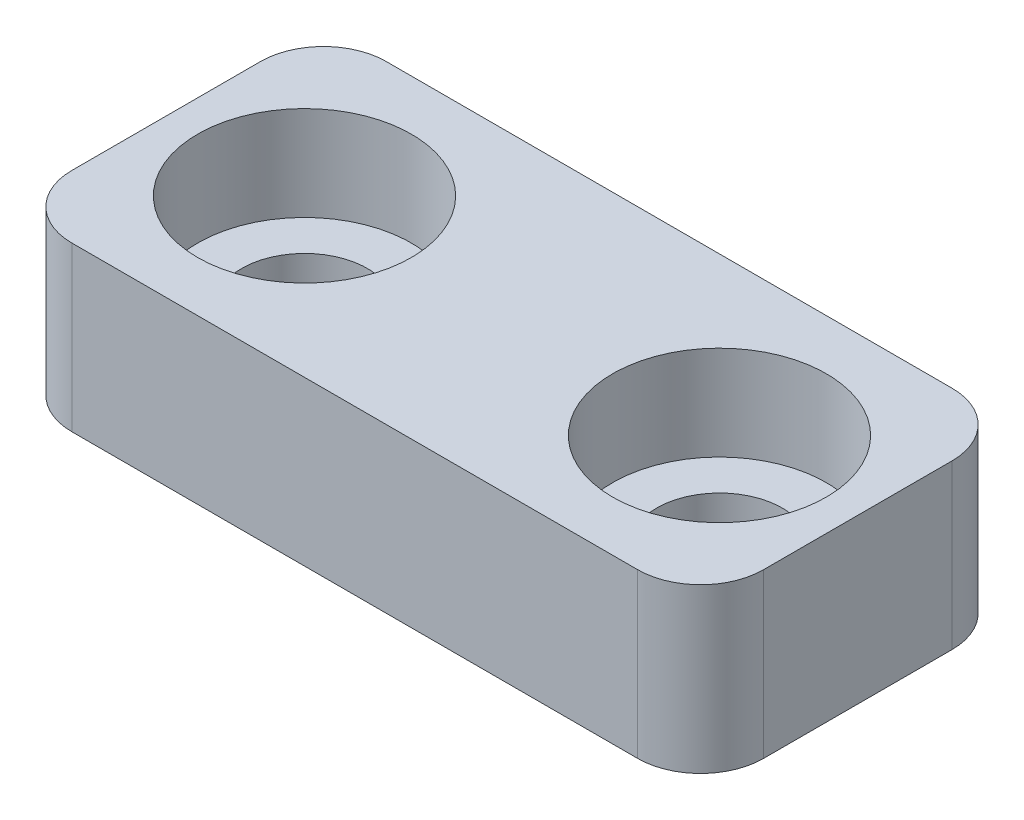
ISO-10303-21;
HEADER;
FILE_DESCRIPTION(('STEP AP214'),'2;1');
FILE_NAME('part.step','',(''),(''),'','','');
FILE_SCHEMA(('AUTOMOTIVE_DESIGN { 1 0 10303 214 1 1 1 1 }'));
ENDSEC;
DATA;
#1=APPLICATION_CONTEXT('core data for automotive mechanical design processes');
#2=APPLICATION_PROTOCOL_DEFINITION('international standard','automotive_design',2000,#1);
#3=PRODUCT_CONTEXT('',#1,'mechanical');
#4=PRODUCT('Part','Part','',(#3));
#5=PRODUCT_RELATED_PRODUCT_CATEGORY('part','',(#4));
#6=PRODUCT_DEFINITION_FORMATION('','',#4);
#7=PRODUCT_DEFINITION_CONTEXT('part definition',#1,'design');
#8=PRODUCT_DEFINITION('design','',#6,#7);
#9=PRODUCT_DEFINITION_SHAPE('','',#8);
#10=(LENGTH_UNIT() NAMED_UNIT(*) SI_UNIT(.MILLI.,.METRE.));
#11=(NAMED_UNIT(*) PLANE_ANGLE_UNIT() SI_UNIT($,.RADIAN.));
#12=(NAMED_UNIT(*) SI_UNIT($,.STERADIAN.) SOLID_ANGLE_UNIT());
#13=UNCERTAINTY_MEASURE_WITH_UNIT(LENGTH_MEASURE(1.E-05),#10,'distance_accuracy_value','');
#14=(GEOMETRIC_REPRESENTATION_CONTEXT(3) GLOBAL_UNCERTAINTY_ASSIGNED_CONTEXT((#13)) GLOBAL_UNIT_ASSIGNED_CONTEXT((#10,
#11,#12)) REPRESENTATION_CONTEXT('',''));
#15=CARTESIAN_POINT('',(0.,0.,0.));
#16=DIRECTION('',(0.,0.,1.));
#17=DIRECTION('',(1.,0.,0.));
#18=AXIS2_PLACEMENT_3D('',#15,#16,#17);
#19=CARTESIAN_POINT('',(3.30000000000001,2.6,0.));
#20=DIRECTION('',(0.,-1.,0.));
#21=DIRECTION('',(0.,0.,-1.));
#22=AXIS2_PLACEMENT_3D('',#19,#20,#21);
#23=CYLINDRICAL_SURFACE('',#22,0.999999999999999);
#24=CARTESIAN_POINT('',(3.30000000000001,0.,0.));
#25=DIRECTION('',(0.,1.,0.));
#26=DIRECTION('',(0.,0.,1.));
#27=AXIS2_PLACEMENT_3D('',#24,#25,#26);
#28=CIRCLE('',#27,0.999999999999999);
#29=CARTESIAN_POINT('',(3.30000000000001,0.,0.999999999999999));
#30=VERTEX_POINT('',#29);
#31=EDGE_CURVE('E136',#30,#30,#28,.T.);
#32=ORIENTED_EDGE('',*,*,#31,.F.);
#33=EDGE_LOOP('',(#32));
#34=FACE_BOUND('',#33,.T.);
#35=CARTESIAN_POINT('',(3.30000000000001,1.1,0.));
#36=DIRECTION('',(0.,1.,0.));
#37=DIRECTION('',(0.,0.,1.));
#38=AXIS2_PLACEMENT_3D('',#35,#36,#37);
#39=CIRCLE('',#38,0.999999999999999);
#40=CARTESIAN_POINT('',(3.30000000000001,1.1,0.999999999999999));
#41=VERTEX_POINT('',#40);
#42=EDGE_CURVE('E149',#41,#41,#39,.T.);
#43=ORIENTED_EDGE('',*,*,#42,.T.);
#44=EDGE_LOOP('',(#43));
#45=FACE_BOUND('',#44,.T.);
#46=ADVANCED_FACE('F36',(#34,#45),#23,.F.);
#47=CARTESIAN_POINT('',(-3.29999999999999,2.6,0.));
#48=DIRECTION('',(0.,-1.,0.));
#49=DIRECTION('',(0.,0.,-1.));
#50=AXIS2_PLACEMENT_3D('',#47,#48,#49);
#51=CYLINDRICAL_SURFACE('',#50,1.);
#52=CARTESIAN_POINT('',(-3.29999999999999,0.,0.));
#53=DIRECTION('',(0.,1.,0.));
#54=DIRECTION('',(0.,0.,1.));
#55=AXIS2_PLACEMENT_3D('',#52,#53,#54);
#56=CIRCLE('',#55,1.);
#57=CARTESIAN_POINT('',(-3.29999999999999,0.,1.));
#58=VERTEX_POINT('',#57);
#59=EDGE_CURVE('E130',#58,#58,#56,.T.);
#60=ORIENTED_EDGE('',*,*,#59,.F.);
#61=EDGE_LOOP('',(#60));
#62=FACE_BOUND('',#61,.T.);
#63=CARTESIAN_POINT('',(-3.29999999999999,1.1,0.));
#64=DIRECTION('',(0.,1.,0.));
#65=DIRECTION('',(0.,0.,1.));
#66=AXIS2_PLACEMENT_3D('',#63,#64,#65);
#67=CIRCLE('',#66,1.);
#68=CARTESIAN_POINT('',(-3.29999999999999,1.1,1.));
#69=VERTEX_POINT('',#68);
#70=EDGE_CURVE('E145',#69,#69,#67,.T.);
#71=ORIENTED_EDGE('',*,*,#70,.T.);
#72=EDGE_LOOP('',(#71));
#73=FACE_BOUND('',#72,.T.);
#74=ADVANCED_FACE('F216',(#62,#73),#51,.F.);
#75=CARTESIAN_POINT('',(0.,2.6,0.));
#76=DIRECTION('',(0.,-1.,0.));
#77=DIRECTION('',(0.,0.,-1.));
#78=AXIS2_PLACEMENT_3D('',#75,#76,#77);
#79=PLANE('',#78);
#80=CARTESIAN_POINT('',(3.30000000000001,2.6,0.));
#81=DIRECTION('',(0.,1.,0.));
#82=DIRECTION('',(0.,0.,1.));
#83=AXIS2_PLACEMENT_3D('',#80,#81,#82);
#84=CIRCLE('',#83,1.7);
#85=CARTESIAN_POINT('',(3.30000000000001,2.6,1.7));
#86=VERTEX_POINT('',#85);
#87=EDGE_CURVE('E198',#86,#86,#84,.T.);
#88=ORIENTED_EDGE('',*,*,#87,.F.);
#89=EDGE_LOOP('',(#88));
#90=FACE_BOUND('',#89,.T.);
#91=CARTESIAN_POINT('',(-3.29999999999999,2.6,0.));
#92=DIRECTION('',(0.,1.,0.));
#93=DIRECTION('',(0.,0.,1.));
#94=AXIS2_PLACEMENT_3D('',#91,#92,#93);
#95=CIRCLE('',#94,1.7);
#96=CARTESIAN_POINT('',(-3.29999999999999,2.6,1.7));
#97=VERTEX_POINT('',#96);
#98=EDGE_CURVE('E152',#97,#97,#95,.T.);
#99=ORIENTED_EDGE('',*,*,#98,.F.);
#100=EDGE_LOOP('',(#99));
#101=FACE_BOUND('',#100,.T.);
#102=DIRECTION('',(1.,0.,0.));
#103=VECTOR('',#102,1.);
#104=CARTESIAN_POINT('',(-5.49999999999999,2.6,2.50000000000001));
#105=LINE('',#104,#103);
#106=CARTESIAN_POINT('',(-4.49999999999999,2.6,2.50000000000001));
#107=VERTEX_POINT('',#106);
#108=CARTESIAN_POINT('',(4.50000000000001,2.6,2.50000000000001));
#109=VERTEX_POINT('',#108);
#110=EDGE_CURVE('E139',#107,#109,#105,.T.);
#111=ORIENTED_EDGE('',*,*,#110,.T.);
#112=CARTESIAN_POINT('',(4.50000000000001,2.6,1.50000000000001));
#113=DIRECTION('',(0.,-1.,0.));
#114=DIRECTION('',(0.,0.,-1.));
#115=AXIS2_PLACEMENT_3D('',#112,#113,#114);
#116=CIRCLE('',#115,1.);
#117=CARTESIAN_POINT('',(5.50000000000001,2.6,1.50000000000001));
#118=VERTEX_POINT('',#117);
#119=EDGE_CURVE('E167',#109,#118,#116,.F.);
#120=ORIENTED_EDGE('',*,*,#119,.T.);
#121=DIRECTION('',(0.,0.,-1.));
#122=VECTOR('',#121,1.);
#123=CARTESIAN_POINT('',(5.50000000000001,2.6,2.50000000000001));
#124=LINE('',#123,#122);
#125=CARTESIAN_POINT('',(5.50000000000001,2.6,-1.5));
#126=VERTEX_POINT('',#125);
#127=EDGE_CURVE('E122',#118,#126,#124,.T.);
#128=ORIENTED_EDGE('',*,*,#127,.T.);
#129=CARTESIAN_POINT('',(4.50000000000001,2.6,-1.5));
#130=DIRECTION('',(0.,-1.,0.));
#131=DIRECTION('',(0.,0.,-1.));
#132=AXIS2_PLACEMENT_3D('',#129,#130,#131);
#133=CIRCLE('',#132,1.);
#134=CARTESIAN_POINT('',(4.50000000000001,2.6,-2.5));
#135=VERTEX_POINT('',#134);
#136=EDGE_CURVE('E165',#126,#135,#133,.F.);
#137=ORIENTED_EDGE('',*,*,#136,.T.);
#138=DIRECTION('',(-1.,0.,0.));
#139=VECTOR('',#138,1.);
#140=CARTESIAN_POINT('',(-5.49999999999999,2.6,-2.5));
#141=LINE('',#140,#139);
#142=CARTESIAN_POINT('',(-4.49999999999999,2.6,-2.5));
#143=VERTEX_POINT('',#142);
#144=EDGE_CURVE('E178',#135,#143,#141,.T.);
#145=ORIENTED_EDGE('',*,*,#144,.T.);
#146=CARTESIAN_POINT('',(-4.49999999999999,2.6,-1.5));
#147=DIRECTION('',(0.,-1.,0.));
#148=DIRECTION('',(0.,0.,-1.));
#149=AXIS2_PLACEMENT_3D('',#146,#147,#148);
#150=CIRCLE('',#149,1.);
#151=CARTESIAN_POINT('',(-5.49999999999999,2.6,-1.5));
#152=VERTEX_POINT('',#151);
#153=EDGE_CURVE('E57',#143,#152,#150,.F.);
#154=ORIENTED_EDGE('',*,*,#153,.T.);
#155=DIRECTION('',(0.,0.,1.));
#156=VECTOR('',#155,1.);
#157=CARTESIAN_POINT('',(-5.49999999999999,2.6,2.50000000000001));
#158=LINE('',#157,#156);
#159=CARTESIAN_POINT('',(-5.49999999999999,2.6,1.50000000000001));
#160=VERTEX_POINT('',#159);
#161=EDGE_CURVE('E186',#152,#160,#158,.T.);
#162=ORIENTED_EDGE('',*,*,#161,.T.);
#163=CARTESIAN_POINT('',(-4.49999999999999,2.6,1.50000000000001));
#164=DIRECTION('',(0.,-1.,0.));
#165=DIRECTION('',(0.,0.,-1.));
#166=AXIS2_PLACEMENT_3D('',#163,#164,#165);
#167=CIRCLE('',#166,1.);
#168=EDGE_CURVE('E162',#160,#107,#167,.F.);
#169=ORIENTED_EDGE('',*,*,#168,.T.);
#170=EDGE_LOOP('',(#111,#120,#128,#137,#145,#154,#162,#169));
#171=FACE_BOUND('',#170,.T.);
#172=ADVANCED_FACE('F213',(#90,#101,#171),#79,.F.);
#173=CARTESIAN_POINT('',(0.,0.,0.));
#174=DIRECTION('',(0.,-1.,0.));
#175=DIRECTION('',(0.,0.,-1.));
#176=AXIS2_PLACEMENT_3D('',#173,#174,#175);
#177=PLANE('',#176);
#178=ORIENTED_EDGE('',*,*,#59,.T.);
#179=EDGE_LOOP('',(#178));
#180=FACE_BOUND('',#179,.T.);
#181=DIRECTION('',(0.,0.,-1.));
#182=VECTOR('',#181,1.);
#183=CARTESIAN_POINT('',(5.50000000000001,0.,2.50000000000001));
#184=LINE('',#183,#182);
#185=CARTESIAN_POINT('',(5.50000000000001,0.,1.50000000000001));
#186=VERTEX_POINT('',#185);
#187=CARTESIAN_POINT('',(5.50000000000001,0.,-1.5));
#188=VERTEX_POINT('',#187);
#189=EDGE_CURVE('E119',#186,#188,#184,.T.);
#190=ORIENTED_EDGE('',*,*,#189,.F.);
#191=CARTESIAN_POINT('',(4.50000000000001,0.,1.50000000000001));
#192=DIRECTION('',(0.,-1.,0.));
#193=DIRECTION('',(0.,0.,-1.));
#194=AXIS2_PLACEMENT_3D('',#191,#192,#193);
#195=CIRCLE('',#194,1.);
#196=CARTESIAN_POINT('',(4.50000000000001,0.,2.50000000000001));
#197=VERTEX_POINT('',#196);
#198=EDGE_CURVE('E102',#186,#197,#195,.T.);
#199=ORIENTED_EDGE('',*,*,#198,.T.);
#200=DIRECTION('',(1.,0.,0.));
#201=VECTOR('',#200,1.);
#202=CARTESIAN_POINT('',(-5.49999999999999,0.,2.50000000000001));
#203=LINE('',#202,#201);
#204=CARTESIAN_POINT('',(-4.49999999999999,0.,2.50000000000001));
#205=VERTEX_POINT('',#204);
#206=EDGE_CURVE('E143',#205,#197,#203,.T.);
#207=ORIENTED_EDGE('',*,*,#206,.F.);
#208=CARTESIAN_POINT('',(-4.49999999999999,0.,1.50000000000001));
#209=DIRECTION('',(0.,-1.,0.));
#210=DIRECTION('',(0.,0.,-1.));
#211=AXIS2_PLACEMENT_3D('',#208,#209,#210);
#212=CIRCLE('',#211,1.);
#213=CARTESIAN_POINT('',(-5.49999999999999,0.,1.50000000000001));
#214=VERTEX_POINT('',#213);
#215=EDGE_CURVE('E123',#205,#214,#212,.T.);
#216=ORIENTED_EDGE('',*,*,#215,.T.);
#217=DIRECTION('',(0.,0.,1.));
#218=VECTOR('',#217,1.);
#219=CARTESIAN_POINT('',(-5.49999999999999,0.,2.50000000000001));
#220=LINE('',#219,#218);
#221=CARTESIAN_POINT('',(-5.49999999999999,0.,-1.5));
#222=VERTEX_POINT('',#221);
#223=EDGE_CURVE('E133',#222,#214,#220,.T.);
#224=ORIENTED_EDGE('',*,*,#223,.F.);
#225=CARTESIAN_POINT('',(-4.49999999999999,0.,-1.5));
#226=DIRECTION('',(0.,-1.,0.));
#227=DIRECTION('',(0.,0.,-1.));
#228=AXIS2_PLACEMENT_3D('',#225,#226,#227);
#229=CIRCLE('',#228,1.);
#230=CARTESIAN_POINT('',(-4.49999999999999,0.,-2.5));
#231=VERTEX_POINT('',#230);
#232=EDGE_CURVE('E156',#222,#231,#229,.T.);
#233=ORIENTED_EDGE('',*,*,#232,.T.);
#234=DIRECTION('',(-1.,0.,0.));
#235=VECTOR('',#234,1.);
#236=CARTESIAN_POINT('',(-5.49999999999999,0.,-2.5));
#237=LINE('',#236,#235);
#238=CARTESIAN_POINT('',(4.50000000000001,0.,-2.5));
#239=VERTEX_POINT('',#238);
#240=EDGE_CURVE('E129',#239,#231,#237,.T.);
#241=ORIENTED_EDGE('',*,*,#240,.F.);
#242=CARTESIAN_POINT('',(4.50000000000001,0.,-1.5));
#243=DIRECTION('',(0.,-1.,0.));
#244=DIRECTION('',(0.,0.,-1.));
#245=AXIS2_PLACEMENT_3D('',#242,#243,#244);
#246=CIRCLE('',#245,1.);
#247=EDGE_CURVE('E113',#239,#188,#246,.T.);
#248=ORIENTED_EDGE('',*,*,#247,.T.);
#249=EDGE_LOOP('',(#190,#199,#207,#216,#224,#233,#241,#248));
#250=FACE_BOUND('',#249,.T.);
#251=ORIENTED_EDGE('',*,*,#31,.T.);
#252=EDGE_LOOP('',(#251));
#253=FACE_BOUND('',#252,.T.);
#254=ADVANCED_FACE('F126',(#180,#250,#253),#177,.T.);
#255=CARTESIAN_POINT('',(5.50000000000001,2.6,2.50000000000001));
#256=DIRECTION('',(-1.,0.,0.));
#257=DIRECTION('',(0.,0.,1.));
#258=AXIS2_PLACEMENT_3D('',#255,#256,#257);
#259=PLANE('',#258);
#260=ORIENTED_EDGE('',*,*,#127,.F.);
#261=DIRECTION('',(0.,-1.,0.));
#262=VECTOR('',#261,1.);
#263=CARTESIAN_POINT('',(5.50000000000001,2.6,1.50000000000001));
#264=LINE('',#263,#262);
#265=EDGE_CURVE('E106',#118,#186,#264,.T.);
#266=ORIENTED_EDGE('',*,*,#265,.T.);
#267=ORIENTED_EDGE('',*,*,#189,.T.);
#268=DIRECTION('',(0.,-1.,0.));
#269=VECTOR('',#268,1.);
#270=CARTESIAN_POINT('',(5.50000000000001,2.6,-1.5));
#271=LINE('',#270,#269);
#272=EDGE_CURVE('E124',#188,#126,#271,.F.);
#273=ORIENTED_EDGE('',*,*,#272,.T.);
#274=EDGE_LOOP('',(#260,#266,#267,#273));
#275=FACE_BOUND('',#274,.T.);
#276=ADVANCED_FACE('F118',(#275),#259,.F.);
#277=CARTESIAN_POINT('',(-5.49999999999999,2.6,-2.5));
#278=DIRECTION('',(0.,0.,1.));
#279=DIRECTION('',(1.,0.,0.));
#280=AXIS2_PLACEMENT_3D('',#277,#278,#279);
#281=PLANE('',#280);
#282=ORIENTED_EDGE('',*,*,#144,.F.);
#283=DIRECTION('',(0.,-1.,0.));
#284=VECTOR('',#283,1.);
#285=CARTESIAN_POINT('',(4.50000000000001,2.6,-2.5));
#286=LINE('',#285,#284);
#287=EDGE_CURVE('E171',#135,#239,#286,.T.);
#288=ORIENTED_EDGE('',*,*,#287,.T.);
#289=ORIENTED_EDGE('',*,*,#240,.T.);
#290=DIRECTION('',(0.,-1.,0.));
#291=VECTOR('',#290,1.);
#292=CARTESIAN_POINT('',(-4.49999999999999,2.6,-2.5));
#293=LINE('',#292,#291);
#294=EDGE_CURVE('E169',#231,#143,#293,.F.);
#295=ORIENTED_EDGE('',*,*,#294,.T.);
#296=EDGE_LOOP('',(#282,#288,#289,#295));
#297=FACE_BOUND('',#296,.T.);
#298=ADVANCED_FACE('F176',(#297),#281,.F.);
#299=CARTESIAN_POINT('',(-5.49999999999999,2.6,2.50000000000001));
#300=DIRECTION('',(1.,0.,0.));
#301=DIRECTION('',(0.,0.,-1.));
#302=AXIS2_PLACEMENT_3D('',#299,#300,#301);
#303=PLANE('',#302);
#304=ORIENTED_EDGE('',*,*,#161,.F.);
#305=DIRECTION('',(0.,-1.,0.));
#306=VECTOR('',#305,1.);
#307=CARTESIAN_POINT('',(-5.49999999999999,2.6,-1.5));
#308=LINE('',#307,#306);
#309=EDGE_CURVE('E11',#152,#222,#308,.T.);
#310=ORIENTED_EDGE('',*,*,#309,.T.);
#311=ORIENTED_EDGE('',*,*,#223,.T.);
#312=DIRECTION('',(0.,-1.,0.));
#313=VECTOR('',#312,1.);
#314=CARTESIAN_POINT('',(-5.49999999999999,2.6,1.50000000000001));
#315=LINE('',#314,#313);
#316=EDGE_CURVE('E44',#214,#160,#315,.F.);
#317=ORIENTED_EDGE('',*,*,#316,.T.);
#318=EDGE_LOOP('',(#304,#310,#311,#317));
#319=FACE_BOUND('',#318,.T.);
#320=ADVANCED_FACE('F185',(#319),#303,.F.);
#321=CARTESIAN_POINT('',(-5.49999999999999,2.6,2.50000000000001));
#322=DIRECTION('',(0.,0.,-1.));
#323=DIRECTION('',(-1.,0.,0.));
#324=AXIS2_PLACEMENT_3D('',#321,#322,#323);
#325=PLANE('',#324);
#326=ORIENTED_EDGE('',*,*,#206,.T.);
#327=DIRECTION('',(0.,-1.,0.));
#328=VECTOR('',#327,1.);
#329=CARTESIAN_POINT('',(4.50000000000001,2.6,2.50000000000001));
#330=LINE('',#329,#328);
#331=EDGE_CURVE('E107',#197,#109,#330,.F.);
#332=ORIENTED_EDGE('',*,*,#331,.T.);
#333=ORIENTED_EDGE('',*,*,#110,.F.);
#334=DIRECTION('',(0.,-1.,0.));
#335=VECTOR('',#334,1.);
#336=CARTESIAN_POINT('',(-4.49999999999999,2.6,2.50000000000001));
#337=LINE('',#336,#335);
#338=EDGE_CURVE('E112',#107,#205,#337,.T.);
#339=ORIENTED_EDGE('',*,*,#338,.T.);
#340=EDGE_LOOP('',(#326,#332,#333,#339));
#341=FACE_BOUND('',#340,.T.);
#342=ADVANCED_FACE('F222',(#341),#325,.F.);
#343=CARTESIAN_POINT('',(-3.29999999999999,1.1,0.));
#344=DIRECTION('',(0.,1.,0.));
#345=DIRECTION('',(0.,0.,1.));
#346=AXIS2_PLACEMENT_3D('',#343,#344,#345);
#347=CYLINDRICAL_SURFACE('',#346,1.7);
#348=CARTESIAN_POINT('',(-3.29999999999999,1.1,0.));
#349=DIRECTION('',(0.,1.,0.));
#350=DIRECTION('',(0.,0.,1.));
#351=AXIS2_PLACEMENT_3D('',#348,#349,#350);
#352=CIRCLE('',#351,1.7);
#353=CARTESIAN_POINT('',(-3.29999999999999,1.1,1.7));
#354=VERTEX_POINT('',#353);
#355=EDGE_CURVE('E148',#354,#354,#352,.T.);
#356=ORIENTED_EDGE('',*,*,#355,.F.);
#357=EDGE_LOOP('',(#356));
#358=FACE_BOUND('',#357,.T.);
#359=ORIENTED_EDGE('',*,*,#98,.T.);
#360=EDGE_LOOP('',(#359));
#361=FACE_BOUND('',#360,.T.);
#362=ADVANCED_FACE('F240',(#358,#361),#347,.F.);
#363=CARTESIAN_POINT('',(-3.29999999999999,1.1,0.));
#364=DIRECTION('',(0.,1.,0.));
#365=DIRECTION('',(0.,0.,1.));
#366=AXIS2_PLACEMENT_3D('',#363,#364,#365);
#367=PLANE('',#366);
#368=ORIENTED_EDGE('',*,*,#70,.F.);
#369=EDGE_LOOP('',(#368));
#370=FACE_BOUND('',#369,.T.);
#371=ORIENTED_EDGE('',*,*,#355,.T.);
#372=EDGE_LOOP('',(#371));
#373=FACE_BOUND('',#372,.T.);
#374=ADVANCED_FACE('F209',(#370,#373),#367,.T.);
#375=CARTESIAN_POINT('',(3.30000000000001,1.1,0.));
#376=DIRECTION('',(0.,1.,0.));
#377=DIRECTION('',(0.,0.,1.));
#378=AXIS2_PLACEMENT_3D('',#375,#376,#377);
#379=CYLINDRICAL_SURFACE('',#378,1.7);
#380=CARTESIAN_POINT('',(3.30000000000001,1.1,0.));
#381=DIRECTION('',(0.,1.,0.));
#382=DIRECTION('',(0.,0.,1.));
#383=AXIS2_PLACEMENT_3D('',#380,#381,#382);
#384=CIRCLE('',#383,1.7);
#385=CARTESIAN_POINT('',(3.30000000000001,1.1,1.7));
#386=VERTEX_POINT('',#385);
#387=EDGE_CURVE('E153',#386,#386,#384,.T.);
#388=ORIENTED_EDGE('',*,*,#387,.F.);
#389=EDGE_LOOP('',(#388));
#390=FACE_BOUND('',#389,.T.);
#391=ORIENTED_EDGE('',*,*,#87,.T.);
#392=EDGE_LOOP('',(#391));
#393=FACE_BOUND('',#392,.T.);
#394=ADVANCED_FACE('F206',(#390,#393),#379,.F.);
#395=CARTESIAN_POINT('',(3.30000000000001,1.1,0.));
#396=DIRECTION('',(0.,1.,0.));
#397=DIRECTION('',(0.,0.,1.));
#398=AXIS2_PLACEMENT_3D('',#395,#396,#397);
#399=PLANE('',#398);
#400=ORIENTED_EDGE('',*,*,#42,.F.);
#401=EDGE_LOOP('',(#400));
#402=FACE_BOUND('',#401,.T.);
#403=ORIENTED_EDGE('',*,*,#387,.T.);
#404=EDGE_LOOP('',(#403));
#405=FACE_BOUND('',#404,.T.);
#406=ADVANCED_FACE('F204',(#402,#405),#399,.T.);
#407=CARTESIAN_POINT('',(4.50000000000001,2.6,1.50000000000001));
#408=DIRECTION('',(0.,-1.,0.));
#409=DIRECTION('',(0.,0.,-1.));
#410=AXIS2_PLACEMENT_3D('',#407,#408,#409);
#411=CYLINDRICAL_SURFACE('',#410,1.);
#412=ORIENTED_EDGE('',*,*,#119,.F.);
#413=ORIENTED_EDGE('',*,*,#331,.F.);
#414=ORIENTED_EDGE('',*,*,#198,.F.);
#415=ORIENTED_EDGE('',*,*,#265,.F.);
#416=EDGE_LOOP('',(#412,#413,#414,#415));
#417=FACE_BOUND('',#416,.T.);
#418=ADVANCED_FACE('F105',(#417),#411,.T.);
#419=CARTESIAN_POINT('',(4.50000000000001,2.6,-1.5));
#420=DIRECTION('',(0.,-1.,0.));
#421=DIRECTION('',(0.,0.,-1.));
#422=AXIS2_PLACEMENT_3D('',#419,#420,#421);
#423=CYLINDRICAL_SURFACE('',#422,1.);
#424=ORIENTED_EDGE('',*,*,#136,.F.);
#425=ORIENTED_EDGE('',*,*,#272,.F.);
#426=ORIENTED_EDGE('',*,*,#247,.F.);
#427=ORIENTED_EDGE('',*,*,#287,.F.);
#428=EDGE_LOOP('',(#424,#425,#426,#427));
#429=FACE_BOUND('',#428,.T.);
#430=ADVANCED_FACE('F228',(#429),#423,.T.);
#431=CARTESIAN_POINT('',(-4.49999999999999,2.6,-1.5));
#432=DIRECTION('',(0.,-1.,0.));
#433=DIRECTION('',(0.,0.,-1.));
#434=AXIS2_PLACEMENT_3D('',#431,#432,#433);
#435=CYLINDRICAL_SURFACE('',#434,1.);
#436=ORIENTED_EDGE('',*,*,#153,.F.);
#437=ORIENTED_EDGE('',*,*,#294,.F.);
#438=ORIENTED_EDGE('',*,*,#232,.F.);
#439=ORIENTED_EDGE('',*,*,#309,.F.);
#440=EDGE_LOOP('',(#436,#437,#438,#439));
#441=FACE_BOUND('',#440,.T.);
#442=ADVANCED_FACE('F184',(#441),#435,.T.);
#443=CARTESIAN_POINT('',(-4.49999999999999,2.6,1.50000000000001));
#444=DIRECTION('',(0.,-1.,0.));
#445=DIRECTION('',(0.,0.,-1.));
#446=AXIS2_PLACEMENT_3D('',#443,#444,#445);
#447=CYLINDRICAL_SURFACE('',#446,1.);
#448=ORIENTED_EDGE('',*,*,#168,.F.);
#449=ORIENTED_EDGE('',*,*,#316,.F.);
#450=ORIENTED_EDGE('',*,*,#215,.F.);
#451=ORIENTED_EDGE('',*,*,#338,.F.);
#452=EDGE_LOOP('',(#448,#449,#450,#451));
#453=FACE_BOUND('',#452,.T.);
#454=ADVANCED_FACE('F38',(#453),#447,.T.);
#455=CLOSED_SHELL('',(#46,#74,#172,#254,#276,#298,#320,#342,#362,#374,#394,#406,#418,#430,#442,#454));
#456=MANIFOLD_SOLID_BREP('B2',#455);
#457=ADVANCED_BREP_SHAPE_REPRESENTATION('',(#18,#456),#14);
#458=SHAPE_DEFINITION_REPRESENTATION(#9,#457);
ENDSEC;
END-ISO-10303-21;
